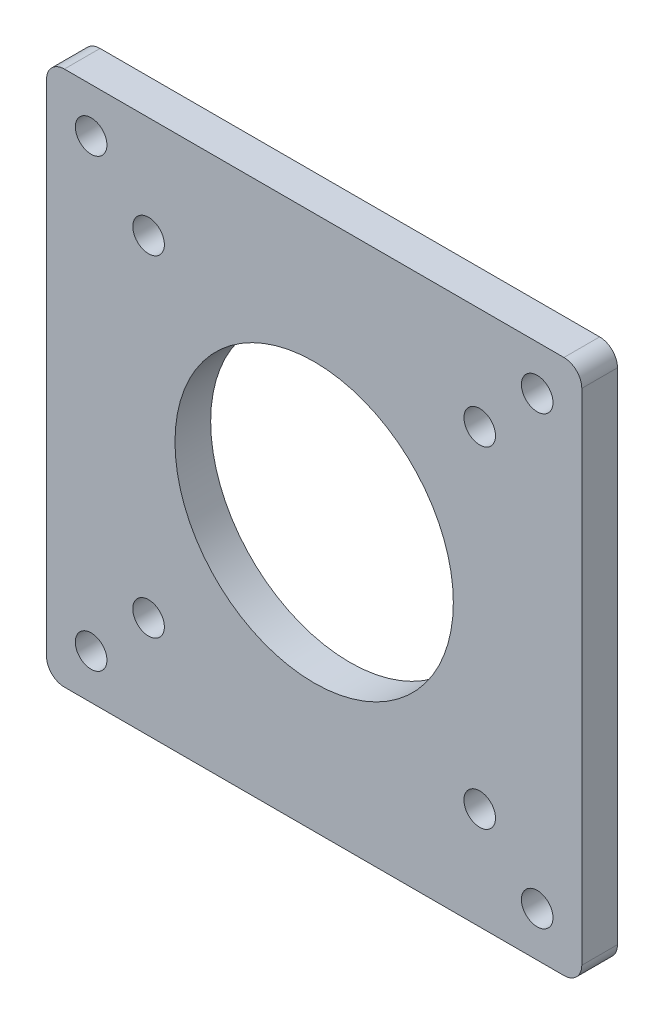
ISO-10303-21;
HEADER;
FILE_DESCRIPTION(('STEP AP214'),'2;1');
FILE_NAME('part.step','',(''),(''),'','','');
FILE_SCHEMA(('AUTOMOTIVE_DESIGN { 1 0 10303 214 1 1 1 1 }'));
ENDSEC;
DATA;
#1=APPLICATION_CONTEXT('core data for automotive mechanical design processes');
#2=APPLICATION_PROTOCOL_DEFINITION('international standard','automotive_design',2000,#1);
#3=PRODUCT_CONTEXT('',#1,'mechanical');
#4=PRODUCT('Part','Part','',(#3));
#5=PRODUCT_RELATED_PRODUCT_CATEGORY('part','',(#4));
#6=PRODUCT_DEFINITION_FORMATION('','',#4);
#7=PRODUCT_DEFINITION_CONTEXT('part definition',#1,'design');
#8=PRODUCT_DEFINITION('design','',#6,#7);
#9=PRODUCT_DEFINITION_SHAPE('','',#8);
#10=(LENGTH_UNIT() NAMED_UNIT(*) SI_UNIT(.MILLI.,.METRE.));
#11=(NAMED_UNIT(*) PLANE_ANGLE_UNIT() SI_UNIT($,.RADIAN.));
#12=(NAMED_UNIT(*) SI_UNIT($,.STERADIAN.) SOLID_ANGLE_UNIT());
#13=UNCERTAINTY_MEASURE_WITH_UNIT(LENGTH_MEASURE(1.E-05),#10,'distance_accuracy_value','');
#14=(GEOMETRIC_REPRESENTATION_CONTEXT(3) GLOBAL_UNCERTAINTY_ASSIGNED_CONTEXT((#13)) GLOBAL_UNIT_ASSIGNED_CONTEXT((#10,
#11,#12)) REPRESENTATION_CONTEXT('',''));
#15=CARTESIAN_POINT('',(0.,0.,0.));
#16=DIRECTION('',(0.,0.,1.));
#17=DIRECTION('',(1.,0.,0.));
#18=AXIS2_PLACEMENT_3D('',#15,#16,#17);
#19=CARTESIAN_POINT('',(0.,0.,0.));
#20=DIRECTION('',(0.,0.,1.));
#21=DIRECTION('',(1.,0.,0.));
#22=AXIS2_PLACEMENT_3D('',#19,#20,#21);
#23=PLANE('',#22);
#24=CARTESIAN_POINT('',(23.57,23.57,0.));
#25=DIRECTION('',(0.,0.,1.));
#26=DIRECTION('',(-1.,0.,0.));
#27=AXIS2_PLACEMENT_3D('',#24,#25,#26);
#28=CIRCLE('',#27,2.2479);
#29=CARTESIAN_POINT('',(21.3221,23.57,0.));
#30=VERTEX_POINT('',#29);
#31=EDGE_CURVE('E189',#30,#30,#28,.T.);
#32=ORIENTED_EDGE('',*,*,#31,.T.);
#33=EDGE_LOOP('',(#32));
#34=FACE_BOUND('',#33,.T.);
#35=CARTESIAN_POINT('',(0.,0.,0.));
#36=DIRECTION('',(0.,0.,1.));
#37=DIRECTION('',(1.,0.,0.));
#38=AXIS2_PLACEMENT_3D('',#35,#36,#37);
#39=CIRCLE('',#38,19.812);
#40=CARTESIAN_POINT('',(19.812,0.,0.));
#41=VERTEX_POINT('',#40);
#42=EDGE_CURVE('E177',#41,#41,#39,.T.);
#43=ORIENTED_EDGE('',*,*,#42,.T.);
#44=EDGE_LOOP('',(#43));
#45=FACE_BOUND('',#44,.T.);
#46=CARTESIAN_POINT('',(-23.57,23.57,0.));
#47=DIRECTION('',(0.,0.,1.));
#48=DIRECTION('',(1.,0.,0.));
#49=AXIS2_PLACEMENT_3D('',#46,#47,#48);
#50=CIRCLE('',#49,2.2479);
#51=CARTESIAN_POINT('',(-21.3221,23.57,0.));
#52=VERTEX_POINT('',#51);
#53=EDGE_CURVE('E165',#52,#52,#50,.T.);
#54=ORIENTED_EDGE('',*,*,#53,.T.);
#55=EDGE_LOOP('',(#54));
#56=FACE_BOUND('',#55,.T.);
#57=CARTESIAN_POINT('',(-23.57,-23.57,0.));
#58=DIRECTION('',(0.,0.,1.));
#59=DIRECTION('',(-1.,0.,0.));
#60=AXIS2_PLACEMENT_3D('',#57,#58,#59);
#61=CIRCLE('',#60,2.24789999999999);
#62=CARTESIAN_POINT('',(-25.8179,-23.57,0.));
#63=VERTEX_POINT('',#62);
#64=EDGE_CURVE('E171',#63,#63,#61,.T.);
#65=ORIENTED_EDGE('',*,*,#64,.T.);
#66=EDGE_LOOP('',(#65));
#67=FACE_BOUND('',#66,.T.);
#68=CARTESIAN_POINT('',(23.57,-23.5699999999999,0.));
#69=DIRECTION('',(0.,0.,1.));
#70=DIRECTION('',(1.,0.,0.));
#71=AXIS2_PLACEMENT_3D('',#68,#69,#70);
#72=CIRCLE('',#71,2.24789999999999);
#73=CARTESIAN_POINT('',(25.8179,-23.5699999999999,0.));
#74=VERTEX_POINT('',#73);
#75=EDGE_CURVE('E183',#74,#74,#72,.T.);
#76=ORIENTED_EDGE('',*,*,#75,.T.);
#77=EDGE_LOOP('',(#76));
#78=FACE_BOUND('',#77,.T.);
#79=DIRECTION('',(0.,1.,0.));
#80=VECTOR('',#79,1.);
#81=CARTESIAN_POINT('',(-38.1,-38.1000000000001,0.));
#82=LINE('',#81,#80);
#83=CARTESIAN_POINT('',(-38.1,-35.5600000000001,0.));
#84=VERTEX_POINT('',#83);
#85=CARTESIAN_POINT('',(-38.1,35.5600000000001,0.));
#86=VERTEX_POINT('',#85);
#87=EDGE_CURVE('E108',#84,#86,#82,.T.);
#88=ORIENTED_EDGE('',*,*,#87,.T.);
#89=CARTESIAN_POINT('',(-35.56,35.5600000000001,0.));
#90=DIRECTION('',(0.,0.,1.));
#91=DIRECTION('',(1.,0.,0.));
#92=AXIS2_PLACEMENT_3D('',#89,#90,#91);
#93=CIRCLE('',#92,2.54);
#94=CARTESIAN_POINT('',(-35.56,38.1000000000001,0.));
#95=VERTEX_POINT('',#94);
#96=EDGE_CURVE('E156',#86,#95,#93,.F.);
#97=ORIENTED_EDGE('',*,*,#96,.T.);
#98=DIRECTION('',(1.,0.,0.));
#99=VECTOR('',#98,1.);
#100=CARTESIAN_POINT('',(38.1000000000001,38.1000000000001,0.));
#101=LINE('',#100,#99);
#102=CARTESIAN_POINT('',(35.5600000000001,38.1000000000001,0.));
#103=VERTEX_POINT('',#102);
#104=EDGE_CURVE('E197',#95,#103,#101,.T.);
#105=ORIENTED_EDGE('',*,*,#104,.T.);
#106=CARTESIAN_POINT('',(35.5600000000001,35.5600000000001,0.));
#107=DIRECTION('',(0.,0.,1.));
#108=DIRECTION('',(1.,0.,0.));
#109=AXIS2_PLACEMENT_3D('',#106,#107,#108);
#110=CIRCLE('',#109,2.54);
#111=CARTESIAN_POINT('',(38.1000000000001,35.5600000000001,0.));
#112=VERTEX_POINT('',#111);
#113=EDGE_CURVE('E162',#103,#112,#110,.F.);
#114=ORIENTED_EDGE('',*,*,#113,.T.);
#115=DIRECTION('',(0.,-1.,0.));
#116=VECTOR('',#115,1.);
#117=CARTESIAN_POINT('',(38.1000000000001,-38.1000000000001,0.));
#118=LINE('',#117,#116);
#119=CARTESIAN_POINT('',(38.1000000000001,-35.5600000000001,0.));
#120=VERTEX_POINT('',#119);
#121=EDGE_CURVE('E142',#112,#120,#118,.T.);
#122=ORIENTED_EDGE('',*,*,#121,.T.);
#123=CARTESIAN_POINT('',(35.5600000000001,-35.5600000000001,0.));
#124=DIRECTION('',(0.,0.,1.));
#125=DIRECTION('',(1.,0.,0.));
#126=AXIS2_PLACEMENT_3D('',#123,#124,#125);
#127=CIRCLE('',#126,2.54);
#128=CARTESIAN_POINT('',(35.5600000000001,-38.1000000000001,0.));
#129=VERTEX_POINT('',#128);
#130=EDGE_CURVE('E160',#120,#129,#127,.F.);
#131=ORIENTED_EDGE('',*,*,#130,.T.);
#132=DIRECTION('',(-1.,0.,0.));
#133=VECTOR('',#132,1.);
#134=CARTESIAN_POINT('',(38.1000000000001,-38.1000000000001,0.));
#135=LINE('',#134,#133);
#136=CARTESIAN_POINT('',(-35.56,-38.1000000000001,0.));
#137=VERTEX_POINT('',#136);
#138=EDGE_CURVE('E119',#129,#137,#135,.T.);
#139=ORIENTED_EDGE('',*,*,#138,.T.);
#140=CARTESIAN_POINT('',(-35.56,-35.5600000000001,0.));
#141=DIRECTION('',(0.,0.,1.));
#142=DIRECTION('',(1.,0.,0.));
#143=AXIS2_PLACEMENT_3D('',#140,#141,#142);
#144=CIRCLE('',#143,2.54);
#145=EDGE_CURVE('E158',#137,#84,#144,.F.);
#146=ORIENTED_EDGE('',*,*,#145,.T.);
#147=EDGE_LOOP('',(#88,#97,#105,#114,#122,#131,#139,#146));
#148=FACE_BOUND('',#147,.T.);
#149=CARTESIAN_POINT('',(31.75,31.75,0.));
#150=DIRECTION('',(0.,0.,-1.));
#151=DIRECTION('',(-1.,0.,0.));
#152=AXIS2_PLACEMENT_3D('',#149,#150,#151);
#153=CIRCLE('',#152,2.2479);
#154=CARTESIAN_POINT('',(29.5021,31.75,0.));
#155=VERTEX_POINT('',#154);
#156=EDGE_CURVE('E206',#155,#155,#153,.T.);
#157=ORIENTED_EDGE('',*,*,#156,.F.);
#158=EDGE_LOOP('',(#157));
#159=FACE_BOUND('',#158,.T.);
#160=CARTESIAN_POINT('',(31.75,-31.75,0.));
#161=DIRECTION('',(0.,0.,-1.));
#162=DIRECTION('',(-1.,0.,0.));
#163=AXIS2_PLACEMENT_3D('',#160,#161,#162);
#164=CIRCLE('',#163,2.2479);
#165=CARTESIAN_POINT('',(29.5021,-31.75,0.));
#166=VERTEX_POINT('',#165);
#167=EDGE_CURVE('E212',#166,#166,#164,.T.);
#168=ORIENTED_EDGE('',*,*,#167,.F.);
#169=EDGE_LOOP('',(#168));
#170=FACE_BOUND('',#169,.T.);
#171=CARTESIAN_POINT('',(-31.75,-31.75,0.));
#172=DIRECTION('',(0.,0.,-1.));
#173=DIRECTION('',(-1.,0.,0.));
#174=AXIS2_PLACEMENT_3D('',#171,#172,#173);
#175=CIRCLE('',#174,2.2479);
#176=CARTESIAN_POINT('',(-33.9979,-31.75,0.));
#177=VERTEX_POINT('',#176);
#178=EDGE_CURVE('E218',#177,#177,#175,.T.);
#179=ORIENTED_EDGE('',*,*,#178,.F.);
#180=EDGE_LOOP('',(#179));
#181=FACE_BOUND('',#180,.T.);
#182=CARTESIAN_POINT('',(-31.75,31.75,0.));
#183=DIRECTION('',(0.,0.,-1.));
#184=DIRECTION('',(-1.,0.,0.));
#185=AXIS2_PLACEMENT_3D('',#182,#183,#184);
#186=CIRCLE('',#185,2.2479);
#187=CARTESIAN_POINT('',(-33.9979,31.75,0.));
#188=VERTEX_POINT('',#187);
#189=EDGE_CURVE('E224',#188,#188,#186,.T.);
#190=ORIENTED_EDGE('',*,*,#189,.F.);
#191=EDGE_LOOP('',(#190));
#192=FACE_BOUND('',#191,.T.);
#193=ADVANCED_FACE('F34',(#34,#45,#56,#67,#78,#148,#159,#170,#181,#192),#23,.F.);
#194=CARTESIAN_POINT('',(0.,0.,5.08));
#195=DIRECTION('',(0.,0.,1.));
#196=DIRECTION('',(1.,0.,0.));
#197=AXIS2_PLACEMENT_3D('',#194,#195,#196);
#198=PLANE('',#197);
#199=CARTESIAN_POINT('',(-31.75,31.75,5.08));
#200=DIRECTION('',(0.,0.,-1.));
#201=DIRECTION('',(-1.,0.,0.));
#202=AXIS2_PLACEMENT_3D('',#199,#200,#201);
#203=CIRCLE('',#202,2.2479);
#204=CARTESIAN_POINT('',(-33.9979,31.75,5.08));
#205=VERTEX_POINT('',#204);
#206=EDGE_CURVE('E221',#205,#205,#203,.T.);
#207=ORIENTED_EDGE('',*,*,#206,.T.);
#208=EDGE_LOOP('',(#207));
#209=FACE_BOUND('',#208,.T.);
#210=CARTESIAN_POINT('',(-31.75,-31.75,5.08));
#211=DIRECTION('',(0.,0.,-1.));
#212=DIRECTION('',(-1.,0.,0.));
#213=AXIS2_PLACEMENT_3D('',#210,#211,#212);
#214=CIRCLE('',#213,2.2479);
#215=CARTESIAN_POINT('',(-33.9979,-31.75,5.08));
#216=VERTEX_POINT('',#215);
#217=EDGE_CURVE('E215',#216,#216,#214,.T.);
#218=ORIENTED_EDGE('',*,*,#217,.T.);
#219=EDGE_LOOP('',(#218));
#220=FACE_BOUND('',#219,.T.);
#221=CARTESIAN_POINT('',(31.75,-31.75,5.08));
#222=DIRECTION('',(0.,0.,-1.));
#223=DIRECTION('',(-1.,0.,0.));
#224=AXIS2_PLACEMENT_3D('',#221,#222,#223);
#225=CIRCLE('',#224,2.2479);
#226=CARTESIAN_POINT('',(29.5021,-31.75,5.08));
#227=VERTEX_POINT('',#226);
#228=EDGE_CURVE('E209',#227,#227,#225,.T.);
#229=ORIENTED_EDGE('',*,*,#228,.T.);
#230=EDGE_LOOP('',(#229));
#231=FACE_BOUND('',#230,.T.);
#232=CARTESIAN_POINT('',(31.75,31.75,5.08));
#233=DIRECTION('',(0.,0.,-1.));
#234=DIRECTION('',(-1.,0.,0.));
#235=AXIS2_PLACEMENT_3D('',#232,#233,#234);
#236=CIRCLE('',#235,2.2479);
#237=CARTESIAN_POINT('',(29.5021,31.75,5.08));
#238=VERTEX_POINT('',#237);
#239=EDGE_CURVE('E201',#238,#238,#236,.T.);
#240=ORIENTED_EDGE('',*,*,#239,.T.);
#241=EDGE_LOOP('',(#240));
#242=FACE_BOUND('',#241,.T.);
#243=DIRECTION('',(1.,0.,0.));
#244=VECTOR('',#243,1.);
#245=CARTESIAN_POINT('',(38.1000000000001,38.1000000000001,5.08));
#246=LINE('',#245,#244);
#247=CARTESIAN_POINT('',(-35.56,38.1000000000001,5.08));
#248=VERTEX_POINT('',#247);
#249=CARTESIAN_POINT('',(35.5600000000001,38.1000000000001,5.08));
#250=VERTEX_POINT('',#249);
#251=EDGE_CURVE('E118',#248,#250,#246,.T.);
#252=ORIENTED_EDGE('',*,*,#251,.F.);
#253=CARTESIAN_POINT('',(-35.56,35.5600000000001,5.08));
#254=DIRECTION('',(0.,0.,1.));
#255=DIRECTION('',(1.,0.,0.));
#256=AXIS2_PLACEMENT_3D('',#253,#254,#255);
#257=CIRCLE('',#256,2.54);
#258=CARTESIAN_POINT('',(-38.1,35.5600000000001,5.08));
#259=VERTEX_POINT('',#258);
#260=EDGE_CURVE('E117',#248,#259,#257,.T.);
#261=ORIENTED_EDGE('',*,*,#260,.T.);
#262=DIRECTION('',(0.,1.,0.));
#263=VECTOR('',#262,1.);
#264=CARTESIAN_POINT('',(-38.1,-38.1000000000001,5.08));
#265=LINE('',#264,#263);
#266=CARTESIAN_POINT('',(-38.1,-35.5600000000001,5.08));
#267=VERTEX_POINT('',#266);
#268=EDGE_CURVE('E105',#267,#259,#265,.T.);
#269=ORIENTED_EDGE('',*,*,#268,.F.);
#270=CARTESIAN_POINT('',(-35.56,-35.5600000000001,5.08));
#271=DIRECTION('',(0.,0.,1.));
#272=DIRECTION('',(1.,0.,0.));
#273=AXIS2_PLACEMENT_3D('',#270,#271,#272);
#274=CIRCLE('',#273,2.54);
#275=CARTESIAN_POINT('',(-35.56,-38.1000000000001,5.08));
#276=VERTEX_POINT('',#275);
#277=EDGE_CURVE('E49',#267,#276,#274,.T.);
#278=ORIENTED_EDGE('',*,*,#277,.T.);
#279=DIRECTION('',(-1.,0.,0.));
#280=VECTOR('',#279,1.);
#281=CARTESIAN_POINT('',(38.1000000000001,-38.1000000000001,5.08));
#282=LINE('',#281,#280);
#283=CARTESIAN_POINT('',(35.5600000000001,-38.1000000000001,5.08));
#284=VERTEX_POINT('',#283);
#285=EDGE_CURVE('E147',#284,#276,#282,.T.);
#286=ORIENTED_EDGE('',*,*,#285,.F.);
#287=CARTESIAN_POINT('',(35.5600000000001,-35.5600000000001,5.08));
#288=DIRECTION('',(0.,0.,1.));
#289=DIRECTION('',(1.,0.,0.));
#290=AXIS2_PLACEMENT_3D('',#287,#288,#289);
#291=CIRCLE('',#290,2.54);
#292=CARTESIAN_POINT('',(38.1000000000001,-35.5600000000001,5.08));
#293=VERTEX_POINT('',#292);
#294=EDGE_CURVE('E125',#284,#293,#291,.T.);
#295=ORIENTED_EDGE('',*,*,#294,.T.);
#296=DIRECTION('',(0.,-1.,0.));
#297=VECTOR('',#296,1.);
#298=CARTESIAN_POINT('',(38.1000000000001,-38.1000000000001,5.08));
#299=LINE('',#298,#297);
#300=CARTESIAN_POINT('',(38.1000000000001,35.5600000000001,5.08));
#301=VERTEX_POINT('',#300);
#302=EDGE_CURVE('E139',#301,#293,#299,.T.);
#303=ORIENTED_EDGE('',*,*,#302,.F.);
#304=CARTESIAN_POINT('',(35.5600000000001,35.5600000000001,5.08));
#305=DIRECTION('',(0.,0.,1.));
#306=DIRECTION('',(1.,0.,0.));
#307=AXIS2_PLACEMENT_3D('',#304,#305,#306);
#308=CIRCLE('',#307,2.54);
#309=EDGE_CURVE('E128',#301,#250,#308,.T.);
#310=ORIENTED_EDGE('',*,*,#309,.T.);
#311=EDGE_LOOP('',(#252,#261,#269,#278,#286,#295,#303,#310));
#312=FACE_BOUND('',#311,.T.);
#313=CARTESIAN_POINT('',(23.57,-23.5699999999999,5.08));
#314=DIRECTION('',(0.,0.,1.));
#315=DIRECTION('',(1.,0.,0.));
#316=AXIS2_PLACEMENT_3D('',#313,#314,#315);
#317=CIRCLE('',#316,2.24789999999999);
#318=CARTESIAN_POINT('',(25.8179,-23.5699999999999,5.08));
#319=VERTEX_POINT('',#318);
#320=EDGE_CURVE('E180',#319,#319,#317,.T.);
#321=ORIENTED_EDGE('',*,*,#320,.F.);
#322=EDGE_LOOP('',(#321));
#323=FACE_BOUND('',#322,.T.);
#324=CARTESIAN_POINT('',(-23.57,-23.57,5.08));
#325=DIRECTION('',(0.,0.,1.));
#326=DIRECTION('',(-1.,0.,0.));
#327=AXIS2_PLACEMENT_3D('',#324,#325,#326);
#328=CIRCLE('',#327,2.24789999999999);
#329=CARTESIAN_POINT('',(-25.8179,-23.57,5.08));
#330=VERTEX_POINT('',#329);
#331=EDGE_CURVE('E168',#330,#330,#328,.T.);
#332=ORIENTED_EDGE('',*,*,#331,.F.);
#333=EDGE_LOOP('',(#332));
#334=FACE_BOUND('',#333,.T.);
#335=CARTESIAN_POINT('',(-23.57,23.57,5.08));
#336=DIRECTION('',(0.,0.,1.));
#337=DIRECTION('',(1.,0.,0.));
#338=AXIS2_PLACEMENT_3D('',#335,#336,#337);
#339=CIRCLE('',#338,2.2479);
#340=CARTESIAN_POINT('',(-21.3221,23.57,5.08));
#341=VERTEX_POINT('',#340);
#342=EDGE_CURVE('E111',#341,#341,#339,.T.);
#343=ORIENTED_EDGE('',*,*,#342,.F.);
#344=EDGE_LOOP('',(#343));
#345=FACE_BOUND('',#344,.T.);
#346=CARTESIAN_POINT('',(0.,0.,5.08));
#347=DIRECTION('',(0.,0.,1.));
#348=DIRECTION('',(1.,0.,0.));
#349=AXIS2_PLACEMENT_3D('',#346,#347,#348);
#350=CIRCLE('',#349,19.812);
#351=CARTESIAN_POINT('',(19.812,0.,5.08));
#352=VERTEX_POINT('',#351);
#353=EDGE_CURVE('E174',#352,#352,#350,.T.);
#354=ORIENTED_EDGE('',*,*,#353,.F.);
#355=EDGE_LOOP('',(#354));
#356=FACE_BOUND('',#355,.T.);
#357=CARTESIAN_POINT('',(23.57,23.57,5.08));
#358=DIRECTION('',(0.,0.,1.));
#359=DIRECTION('',(-1.,0.,0.));
#360=AXIS2_PLACEMENT_3D('',#357,#358,#359);
#361=CIRCLE('',#360,2.2479);
#362=CARTESIAN_POINT('',(21.3221,23.57,5.08));
#363=VERTEX_POINT('',#362);
#364=EDGE_CURVE('E186',#363,#363,#361,.T.);
#365=ORIENTED_EDGE('',*,*,#364,.F.);
#366=EDGE_LOOP('',(#365));
#367=FACE_BOUND('',#366,.T.);
#368=ADVANCED_FACE('F114',(#209,#220,#231,#242,#312,#323,#334,#345,#356,#367),#198,.T.);
#369=CARTESIAN_POINT('',(-23.57,23.57,5.08));
#370=DIRECTION('',(0.,0.,-1.));
#371=DIRECTION('',(-1.,0.,0.));
#372=AXIS2_PLACEMENT_3D('',#369,#370,#371);
#373=CYLINDRICAL_SURFACE('',#372,2.2479);
#374=ORIENTED_EDGE('',*,*,#342,.T.);
#375=EDGE_LOOP('',(#374));
#376=FACE_BOUND('',#375,.T.);
#377=ORIENTED_EDGE('',*,*,#53,.F.);
#378=EDGE_LOOP('',(#377));
#379=FACE_BOUND('',#378,.T.);
#380=ADVANCED_FACE('F236',(#376,#379),#373,.F.);
#381=CARTESIAN_POINT('',(-23.57,-23.57,5.08));
#382=DIRECTION('',(0.,0.,-1.));
#383=DIRECTION('',(-1.,0.,0.));
#384=AXIS2_PLACEMENT_3D('',#381,#382,#383);
#385=CYLINDRICAL_SURFACE('',#384,2.24789999999999);
#386=ORIENTED_EDGE('',*,*,#331,.T.);
#387=EDGE_LOOP('',(#386));
#388=FACE_BOUND('',#387,.T.);
#389=ORIENTED_EDGE('',*,*,#64,.F.);
#390=EDGE_LOOP('',(#389));
#391=FACE_BOUND('',#390,.T.);
#392=ADVANCED_FACE('F285',(#388,#391),#385,.F.);
#393=CARTESIAN_POINT('',(0.,0.,5.08));
#394=DIRECTION('',(0.,0.,-1.));
#395=DIRECTION('',(-1.,0.,0.));
#396=AXIS2_PLACEMENT_3D('',#393,#394,#395);
#397=CYLINDRICAL_SURFACE('',#396,19.812);
#398=ORIENTED_EDGE('',*,*,#353,.T.);
#399=EDGE_LOOP('',(#398));
#400=FACE_BOUND('',#399,.T.);
#401=ORIENTED_EDGE('',*,*,#42,.F.);
#402=EDGE_LOOP('',(#401));
#403=FACE_BOUND('',#402,.T.);
#404=ADVANCED_FACE('F281',(#400,#403),#397,.F.);
#405=CARTESIAN_POINT('',(23.57,-23.5699999999999,5.08));
#406=DIRECTION('',(0.,0.,-1.));
#407=DIRECTION('',(-1.,0.,0.));
#408=AXIS2_PLACEMENT_3D('',#405,#406,#407);
#409=CYLINDRICAL_SURFACE('',#408,2.24789999999999);
#410=ORIENTED_EDGE('',*,*,#320,.T.);
#411=EDGE_LOOP('',(#410));
#412=FACE_BOUND('',#411,.T.);
#413=ORIENTED_EDGE('',*,*,#75,.F.);
#414=EDGE_LOOP('',(#413));
#415=FACE_BOUND('',#414,.T.);
#416=ADVANCED_FACE('F277',(#412,#415),#409,.F.);
#417=CARTESIAN_POINT('',(23.57,23.57,5.08));
#418=DIRECTION('',(0.,0.,-1.));
#419=DIRECTION('',(-1.,0.,0.));
#420=AXIS2_PLACEMENT_3D('',#417,#418,#419);
#421=CYLINDRICAL_SURFACE('',#420,2.2479);
#422=ORIENTED_EDGE('',*,*,#364,.T.);
#423=EDGE_LOOP('',(#422));
#424=FACE_BOUND('',#423,.T.);
#425=ORIENTED_EDGE('',*,*,#31,.F.);
#426=EDGE_LOOP('',(#425));
#427=FACE_BOUND('',#426,.T.);
#428=ADVANCED_FACE('F273',(#424,#427),#421,.F.);
#429=CARTESIAN_POINT('',(38.1000000000001,38.1000000000001,5.08));
#430=DIRECTION('',(0.,1.,0.));
#431=DIRECTION('',(0.,0.,1.));
#432=AXIS2_PLACEMENT_3D('',#429,#430,#431);
#433=PLANE('',#432);
#434=ORIENTED_EDGE('',*,*,#104,.F.);
#435=DIRECTION('',(0.,0.,-1.));
#436=VECTOR('',#435,1.);
#437=CARTESIAN_POINT('',(-35.56,38.1000000000001,5.08));
#438=LINE('',#437,#436);
#439=EDGE_CURVE('E152',#95,#248,#438,.F.);
#440=ORIENTED_EDGE('',*,*,#439,.T.);
#441=ORIENTED_EDGE('',*,*,#251,.T.);
#442=DIRECTION('',(0.,0.,-1.));
#443=VECTOR('',#442,1.);
#444=CARTESIAN_POINT('',(35.5600000000001,38.1000000000001,5.08));
#445=LINE('',#444,#443);
#446=EDGE_CURVE('E151',#250,#103,#445,.T.);
#447=ORIENTED_EDGE('',*,*,#446,.T.);
#448=EDGE_LOOP('',(#434,#440,#441,#447));
#449=FACE_BOUND('',#448,.T.);
#450=ADVANCED_FACE('F257',(#449),#433,.T.);
#451=CARTESIAN_POINT('',(-38.1,-38.1000000000001,5.08));
#452=DIRECTION('',(-1.,0.,0.));
#453=DIRECTION('',(0.,0.,1.));
#454=AXIS2_PLACEMENT_3D('',#451,#452,#453);
#455=PLANE('',#454);
#456=ORIENTED_EDGE('',*,*,#268,.T.);
#457=DIRECTION('',(0.,0.,-1.));
#458=VECTOR('',#457,1.);
#459=CARTESIAN_POINT('',(-38.1,35.5600000000001,5.08));
#460=LINE('',#459,#458);
#461=EDGE_CURVE('E110',#259,#86,#460,.T.);
#462=ORIENTED_EDGE('',*,*,#461,.T.);
#463=ORIENTED_EDGE('',*,*,#87,.F.);
#464=DIRECTION('',(0.,0.,-1.));
#465=VECTOR('',#464,1.);
#466=CARTESIAN_POINT('',(-38.1,-35.5600000000001,5.08));
#467=LINE('',#466,#465);
#468=EDGE_CURVE('E102',#84,#267,#467,.F.);
#469=ORIENTED_EDGE('',*,*,#468,.T.);
#470=EDGE_LOOP('',(#456,#462,#463,#469));
#471=FACE_BOUND('',#470,.T.);
#472=ADVANCED_FACE('F103',(#471),#455,.T.);
#473=CARTESIAN_POINT('',(38.1000000000001,-38.1000000000001,5.08));
#474=DIRECTION('',(0.,-1.,0.));
#475=DIRECTION('',(0.,0.,-1.));
#476=AXIS2_PLACEMENT_3D('',#473,#474,#475);
#477=PLANE('',#476);
#478=ORIENTED_EDGE('',*,*,#285,.T.);
#479=DIRECTION('',(0.,0.,-1.));
#480=VECTOR('',#479,1.);
#481=CARTESIAN_POINT('',(-35.56,-38.1000000000001,5.08));
#482=LINE('',#481,#480);
#483=EDGE_CURVE('E124',#276,#137,#482,.T.);
#484=ORIENTED_EDGE('',*,*,#483,.T.);
#485=ORIENTED_EDGE('',*,*,#138,.F.);
#486=DIRECTION('',(0.,0.,-1.));
#487=VECTOR('',#486,1.);
#488=CARTESIAN_POINT('',(35.5600000000001,-38.1000000000001,5.08));
#489=LINE('',#488,#487);
#490=EDGE_CURVE('E56',#129,#284,#489,.F.);
#491=ORIENTED_EDGE('',*,*,#490,.T.);
#492=EDGE_LOOP('',(#478,#484,#485,#491));
#493=FACE_BOUND('',#492,.T.);
#494=ADVANCED_FACE('F259',(#493),#477,.T.);
#495=CARTESIAN_POINT('',(38.1000000000001,-38.1000000000001,5.08));
#496=DIRECTION('',(1.,0.,0.));
#497=DIRECTION('',(0.,0.,-1.));
#498=AXIS2_PLACEMENT_3D('',#495,#496,#497);
#499=PLANE('',#498);
#500=ORIENTED_EDGE('',*,*,#302,.T.);
#501=DIRECTION('',(0.,0.,-1.));
#502=VECTOR('',#501,1.);
#503=CARTESIAN_POINT('',(38.1000000000001,-35.5600000000001,5.08));
#504=LINE('',#503,#502);
#505=EDGE_CURVE('E11',#293,#120,#504,.T.);
#506=ORIENTED_EDGE('',*,*,#505,.T.);
#507=ORIENTED_EDGE('',*,*,#121,.F.);
#508=DIRECTION('',(0.,0.,-1.));
#509=VECTOR('',#508,1.);
#510=CARTESIAN_POINT('',(38.1000000000001,35.5600000000001,5.08));
#511=LINE('',#510,#509);
#512=EDGE_CURVE('E42',#112,#301,#511,.F.);
#513=ORIENTED_EDGE('',*,*,#512,.T.);
#514=EDGE_LOOP('',(#500,#506,#507,#513));
#515=FACE_BOUND('',#514,.T.);
#516=ADVANCED_FACE('F138',(#515),#499,.T.);
#517=CARTESIAN_POINT('',(31.75,31.75,0.));
#518=DIRECTION('',(0.,0.,-1.));
#519=DIRECTION('',(-1.,0.,0.));
#520=AXIS2_PLACEMENT_3D('',#517,#518,#519);
#521=CYLINDRICAL_SURFACE('',#520,2.2479);
#522=ORIENTED_EDGE('',*,*,#239,.F.);
#523=EDGE_LOOP('',(#522));
#524=FACE_BOUND('',#523,.T.);
#525=ORIENTED_EDGE('',*,*,#156,.T.);
#526=EDGE_LOOP('',(#525));
#527=FACE_BOUND('',#526,.T.);
#528=ADVANCED_FACE('F266',(#524,#527),#521,.F.);
#529=CARTESIAN_POINT('',(31.75,-31.75,0.));
#530=DIRECTION('',(0.,0.,-1.));
#531=DIRECTION('',(-1.,0.,0.));
#532=AXIS2_PLACEMENT_3D('',#529,#530,#531);
#533=CYLINDRICAL_SURFACE('',#532,2.2479);
#534=ORIENTED_EDGE('',*,*,#228,.F.);
#535=EDGE_LOOP('',(#534));
#536=FACE_BOUND('',#535,.T.);
#537=ORIENTED_EDGE('',*,*,#167,.T.);
#538=EDGE_LOOP('',(#537));
#539=FACE_BOUND('',#538,.T.);
#540=ADVANCED_FACE('F389',(#536,#539),#533,.F.);
#541=CARTESIAN_POINT('',(-31.75,-31.75,0.));
#542=DIRECTION('',(0.,0.,-1.));
#543=DIRECTION('',(-1.,0.,0.));
#544=AXIS2_PLACEMENT_3D('',#541,#542,#543);
#545=CYLINDRICAL_SURFACE('',#544,2.2479);
#546=ORIENTED_EDGE('',*,*,#217,.F.);
#547=EDGE_LOOP('',(#546));
#548=FACE_BOUND('',#547,.T.);
#549=ORIENTED_EDGE('',*,*,#178,.T.);
#550=EDGE_LOOP('',(#549));
#551=FACE_BOUND('',#550,.T.);
#552=ADVANCED_FACE('F382',(#548,#551),#545,.F.);
#553=CARTESIAN_POINT('',(-31.75,31.75,0.));
#554=DIRECTION('',(0.,0.,-1.));
#555=DIRECTION('',(-1.,0.,0.));
#556=AXIS2_PLACEMENT_3D('',#553,#554,#555);
#557=CYLINDRICAL_SURFACE('',#556,2.2479);
#558=ORIENTED_EDGE('',*,*,#206,.F.);
#559=EDGE_LOOP('',(#558));
#560=FACE_BOUND('',#559,.T.);
#561=ORIENTED_EDGE('',*,*,#189,.T.);
#562=EDGE_LOOP('',(#561));
#563=FACE_BOUND('',#562,.T.);
#564=ADVANCED_FACE('F228',(#560,#563),#557,.F.);
#565=CARTESIAN_POINT('',(-35.56,35.5600000000001,5.08));
#566=DIRECTION('',(0.,0.,-1.));
#567=DIRECTION('',(-1.,0.,0.));
#568=AXIS2_PLACEMENT_3D('',#565,#566,#567);
#569=CYLINDRICAL_SURFACE('',#568,2.54);
#570=ORIENTED_EDGE('',*,*,#260,.F.);
#571=ORIENTED_EDGE('',*,*,#439,.F.);
#572=ORIENTED_EDGE('',*,*,#96,.F.);
#573=ORIENTED_EDGE('',*,*,#461,.F.);
#574=EDGE_LOOP('',(#570,#571,#572,#573));
#575=FACE_BOUND('',#574,.T.);
#576=ADVANCED_FACE('F242',(#575),#569,.T.);
#577=CARTESIAN_POINT('',(-35.56,-35.5600000000001,5.08));
#578=DIRECTION('',(0.,0.,-1.));
#579=DIRECTION('',(-1.,0.,0.));
#580=AXIS2_PLACEMENT_3D('',#577,#578,#579);
#581=CYLINDRICAL_SURFACE('',#580,2.54);
#582=ORIENTED_EDGE('',*,*,#277,.F.);
#583=ORIENTED_EDGE('',*,*,#468,.F.);
#584=ORIENTED_EDGE('',*,*,#145,.F.);
#585=ORIENTED_EDGE('',*,*,#483,.F.);
#586=EDGE_LOOP('',(#582,#583,#584,#585));
#587=FACE_BOUND('',#586,.T.);
#588=ADVANCED_FACE('F122',(#587),#581,.T.);
#589=CARTESIAN_POINT('',(35.5600000000001,-35.5600000000001,5.08));
#590=DIRECTION('',(0.,0.,-1.));
#591=DIRECTION('',(-1.,0.,0.));
#592=AXIS2_PLACEMENT_3D('',#589,#590,#591);
#593=CYLINDRICAL_SURFACE('',#592,2.54);
#594=ORIENTED_EDGE('',*,*,#294,.F.);
#595=ORIENTED_EDGE('',*,*,#490,.F.);
#596=ORIENTED_EDGE('',*,*,#130,.F.);
#597=ORIENTED_EDGE('',*,*,#505,.F.);
#598=EDGE_LOOP('',(#594,#595,#596,#597));
#599=FACE_BOUND('',#598,.T.);
#600=ADVANCED_FACE('F247',(#599),#593,.T.);
#601=CARTESIAN_POINT('',(35.5600000000001,35.5600000000001,5.08));
#602=DIRECTION('',(0.,0.,-1.));
#603=DIRECTION('',(-1.,0.,0.));
#604=AXIS2_PLACEMENT_3D('',#601,#602,#603);
#605=CYLINDRICAL_SURFACE('',#604,2.54);
#606=ORIENTED_EDGE('',*,*,#309,.F.);
#607=ORIENTED_EDGE('',*,*,#512,.F.);
#608=ORIENTED_EDGE('',*,*,#113,.F.);
#609=ORIENTED_EDGE('',*,*,#446,.F.);
#610=EDGE_LOOP('',(#606,#607,#608,#609));
#611=FACE_BOUND('',#610,.T.);
#612=ADVANCED_FACE('F36',(#611),#605,.T.);
#613=CLOSED_SHELL('',(#193,#368,#380,#392,#404,#416,#428,#450,#472,#494,#516,#528,#540,#552,
#564,#576,#588,#600,#612));
#614=MANIFOLD_SOLID_BREP('B2',#613);
#615=ADVANCED_BREP_SHAPE_REPRESENTATION('',(#18,#614),#14);
#616=SHAPE_DEFINITION_REPRESENTATION(#9,#615);
ENDSEC;
END-ISO-10303-21;
